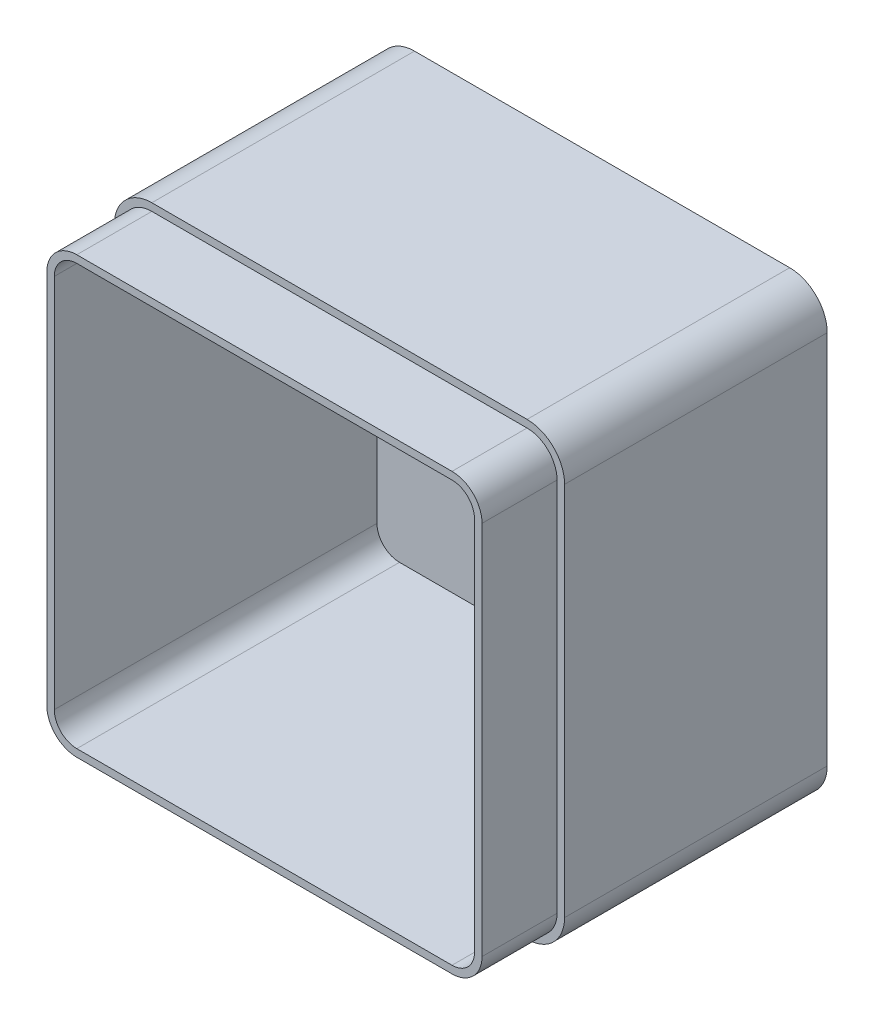
ISO-10303-21;
HEADER;
FILE_DESCRIPTION(('STEP AP214'),'2;1');
FILE_NAME('part.step','',(''),(''),'','','');
FILE_SCHEMA(('AUTOMOTIVE_DESIGN { 1 0 10303 214 1 1 1 1 }'));
ENDSEC;
DATA;
#1=APPLICATION_CONTEXT('core data for automotive mechanical design processes');
#2=APPLICATION_PROTOCOL_DEFINITION('international standard','automotive_design',2000,#1);
#3=PRODUCT_CONTEXT('',#1,'mechanical');
#4=PRODUCT('Part','Part','',(#3));
#5=PRODUCT_RELATED_PRODUCT_CATEGORY('part','',(#4));
#6=PRODUCT_DEFINITION_FORMATION('','',#4);
#7=PRODUCT_DEFINITION_CONTEXT('part definition',#1,'design');
#8=PRODUCT_DEFINITION('design','',#6,#7);
#9=PRODUCT_DEFINITION_SHAPE('','',#8);
#10=(LENGTH_UNIT() NAMED_UNIT(*) SI_UNIT(.MILLI.,.METRE.));
#11=(NAMED_UNIT(*) PLANE_ANGLE_UNIT() SI_UNIT($,.RADIAN.));
#12=(NAMED_UNIT(*) SI_UNIT($,.STERADIAN.) SOLID_ANGLE_UNIT());
#13=UNCERTAINTY_MEASURE_WITH_UNIT(LENGTH_MEASURE(1.E-05),#10,'distance_accuracy_value','');
#14=(GEOMETRIC_REPRESENTATION_CONTEXT(3) GLOBAL_UNCERTAINTY_ASSIGNED_CONTEXT((#13)) GLOBAL_UNIT_ASSIGNED_CONTEXT((#10,
#11,#12)) REPRESENTATION_CONTEXT('',''));
#15=CARTESIAN_POINT('',(0.,0.,0.));
#16=DIRECTION('',(0.,0.,1.));
#17=DIRECTION('',(1.,0.,0.));
#18=AXIS2_PLACEMENT_3D('',#15,#16,#17);
#19=CARTESIAN_POINT('',(0.,0.,90.));
#20=DIRECTION('',(0.,0.,-1.));
#21=DIRECTION('',(-1.,0.,0.));
#22=AXIS2_PLACEMENT_3D('',#19,#20,#21);
#23=PLANE('',#22);
#24=DIRECTION('',(1.,0.,0.));
#25=VECTOR('',#24,1.);
#26=CARTESIAN_POINT('',(0.,4.,90.));
#27=LINE('',#26,#25);
#28=CARTESIAN_POINT('',(9.99999999999999,4.,90.));
#29=VERTEX_POINT('',#28);
#30=CARTESIAN_POINT('',(110.,4.,90.));
#31=VERTEX_POINT('',#30);
#32=EDGE_CURVE('E331',#29,#31,#27,.T.);
#33=ORIENTED_EDGE('',*,*,#32,.F.);
#34=CARTESIAN_POINT('',(10.,10.,90.));
#35=DIRECTION('',(0.,0.,-1.));
#36=DIRECTION('',(-1.,0.,0.));
#37=AXIS2_PLACEMENT_3D('',#34,#35,#36);
#38=CIRCLE('',#37,6.);
#39=CARTESIAN_POINT('',(4.,9.99999999999999,90.));
#40=VERTEX_POINT('',#39);
#41=EDGE_CURVE('E332',#40,#29,#38,.F.);
#42=ORIENTED_EDGE('',*,*,#41,.F.);
#43=DIRECTION('',(0.,-1.,0.));
#44=VECTOR('',#43,1.);
#45=CARTESIAN_POINT('',(4.,0.,90.));
#46=LINE('',#45,#44);
#47=CARTESIAN_POINT('',(4.,110.,90.));
#48=VERTEX_POINT('',#47);
#49=EDGE_CURVE('E313',#48,#40,#46,.T.);
#50=ORIENTED_EDGE('',*,*,#49,.F.);
#51=CARTESIAN_POINT('',(10.,110.,90.));
#52=DIRECTION('',(0.,0.,-1.));
#53=DIRECTION('',(-1.,0.,0.));
#54=AXIS2_PLACEMENT_3D('',#51,#52,#53);
#55=CIRCLE('',#54,6.);
#56=CARTESIAN_POINT('',(9.99999999999999,116.,90.));
#57=VERTEX_POINT('',#56);
#58=EDGE_CURVE('E317',#57,#48,#55,.F.);
#59=ORIENTED_EDGE('',*,*,#58,.F.);
#60=DIRECTION('',(-1.,0.,0.));
#61=VECTOR('',#60,1.);
#62=CARTESIAN_POINT('',(0.,116.,90.));
#63=LINE('',#62,#61);
#64=CARTESIAN_POINT('',(110.,116.,90.));
#65=VERTEX_POINT('',#64);
#66=EDGE_CURVE('E324',#65,#57,#63,.T.);
#67=ORIENTED_EDGE('',*,*,#66,.F.);
#68=CARTESIAN_POINT('',(110.,110.,90.));
#69=DIRECTION('',(0.,0.,-1.));
#70=DIRECTION('',(-1.,0.,0.));
#71=AXIS2_PLACEMENT_3D('',#68,#69,#70);
#72=CIRCLE('',#71,6.);
#73=CARTESIAN_POINT('',(116.,110.,90.));
#74=VERTEX_POINT('',#73);
#75=EDGE_CURVE('E334',#74,#65,#72,.F.);
#76=ORIENTED_EDGE('',*,*,#75,.F.);
#77=DIRECTION('',(0.,1.,0.));
#78=VECTOR('',#77,1.);
#79=CARTESIAN_POINT('',(116.,0.,90.));
#80=LINE('',#79,#78);
#81=CARTESIAN_POINT('',(116.,9.99999999999999,90.));
#82=VERTEX_POINT('',#81);
#83=EDGE_CURVE('E337',#82,#74,#80,.T.);
#84=ORIENTED_EDGE('',*,*,#83,.F.);
#85=CARTESIAN_POINT('',(110.,10.,90.));
#86=DIRECTION('',(0.,0.,-1.));
#87=DIRECTION('',(-1.,0.,0.));
#88=AXIS2_PLACEMENT_3D('',#85,#86,#87);
#89=CIRCLE('',#88,6.);
#90=EDGE_CURVE('E329',#31,#82,#89,.F.);
#91=ORIENTED_EDGE('',*,*,#90,.F.);
#92=EDGE_LOOP('',(#33,#42,#50,#59,#67,#76,#84,#91));
#93=FACE_BOUND('',#92,.T.);
#94=CARTESIAN_POINT('',(10.,10.,90.));
#95=DIRECTION('',(0.,0.,1.));
#96=DIRECTION('',(1.,0.,0.));
#97=AXIS2_PLACEMENT_3D('',#94,#95,#96);
#98=CIRCLE('',#97,8.);
#99=CARTESIAN_POINT('',(2.,9.99999999999999,90.));
#100=VERTEX_POINT('',#99);
#101=CARTESIAN_POINT('',(10.,2.,90.));
#102=VERTEX_POINT('',#101);
#103=EDGE_CURVE('E242',#100,#102,#98,.T.);
#104=ORIENTED_EDGE('',*,*,#103,.T.);
#105=DIRECTION('',(1.,0.,0.));
#106=VECTOR('',#105,1.);
#107=CARTESIAN_POINT('',(10.,2.,90.));
#108=LINE('',#107,#106);
#109=CARTESIAN_POINT('',(110.,2.,90.));
#110=VERTEX_POINT('',#109);
#111=EDGE_CURVE('E202',#102,#110,#108,.T.);
#112=ORIENTED_EDGE('',*,*,#111,.T.);
#113=CARTESIAN_POINT('',(110.,10.,90.));
#114=DIRECTION('',(0.,0.,1.));
#115=DIRECTION('',(1.,0.,0.));
#116=AXIS2_PLACEMENT_3D('',#113,#114,#115);
#117=CIRCLE('',#116,7.99999999999999);
#118=CARTESIAN_POINT('',(118.,10.,90.));
#119=VERTEX_POINT('',#118);
#120=EDGE_CURVE('E50',#110,#119,#117,.T.);
#121=ORIENTED_EDGE('',*,*,#120,.T.);
#122=DIRECTION('',(0.,1.,0.));
#123=VECTOR('',#122,1.);
#124=CARTESIAN_POINT('',(118.,10.,90.));
#125=LINE('',#124,#123);
#126=CARTESIAN_POINT('',(118.,110.,90.));
#127=VERTEX_POINT('',#126);
#128=EDGE_CURVE('E246',#119,#127,#125,.T.);
#129=ORIENTED_EDGE('',*,*,#128,.T.);
#130=CARTESIAN_POINT('',(110.,110.,90.));
#131=DIRECTION('',(0.,0.,1.));
#132=DIRECTION('',(1.,0.,0.));
#133=AXIS2_PLACEMENT_3D('',#130,#131,#132);
#134=CIRCLE('',#133,7.99999999999999);
#135=CARTESIAN_POINT('',(110.,118.,90.));
#136=VERTEX_POINT('',#135);
#137=EDGE_CURVE('E249',#127,#136,#134,.T.);
#138=ORIENTED_EDGE('',*,*,#137,.T.);
#139=DIRECTION('',(-1.,0.,0.));
#140=VECTOR('',#139,1.);
#141=CARTESIAN_POINT('',(110.,118.,90.));
#142=LINE('',#141,#140);
#143=CARTESIAN_POINT('',(9.99999999999999,118.,90.));
#144=VERTEX_POINT('',#143);
#145=EDGE_CURVE('E252',#136,#144,#142,.T.);
#146=ORIENTED_EDGE('',*,*,#145,.T.);
#147=CARTESIAN_POINT('',(10.,110.,90.));
#148=DIRECTION('',(0.,0.,1.));
#149=DIRECTION('',(1.,0.,0.));
#150=AXIS2_PLACEMENT_3D('',#147,#148,#149);
#151=CIRCLE('',#150,7.99999999999999);
#152=CARTESIAN_POINT('',(2.,110.,90.));
#153=VERTEX_POINT('',#152);
#154=EDGE_CURVE('E225',#144,#153,#151,.T.);
#155=ORIENTED_EDGE('',*,*,#154,.T.);
#156=DIRECTION('',(0.,-1.,0.));
#157=VECTOR('',#156,1.);
#158=CARTESIAN_POINT('',(2.,110.,90.));
#159=LINE('',#158,#157);
#160=EDGE_CURVE('E222',#153,#100,#159,.T.);
#161=ORIENTED_EDGE('',*,*,#160,.T.);
#162=EDGE_LOOP('',(#104,#112,#121,#129,#138,#146,#155,#161));
#163=FACE_BOUND('',#162,.T.);
#164=ADVANCED_FACE('F35',(#93,#163),#23,.F.);
#165=CARTESIAN_POINT('',(4.,0.,90.));
#166=DIRECTION('',(1.,0.,0.));
#167=DIRECTION('',(0.,0.,-1.));
#168=AXIS2_PLACEMENT_3D('',#165,#166,#167);
#169=PLANE('',#168);
#170=DIRECTION('',(0.,-1.,0.));
#171=VECTOR('',#170,1.);
#172=CARTESIAN_POINT('',(4.,0.,4.));
#173=LINE('',#172,#171);
#174=CARTESIAN_POINT('',(4.,110.,4.));
#175=VERTEX_POINT('',#174);
#176=CARTESIAN_POINT('',(4.,9.99999999999999,4.));
#177=VERTEX_POINT('',#176);
#178=EDGE_CURVE('E284',#175,#177,#173,.T.);
#179=ORIENTED_EDGE('',*,*,#178,.F.);
#180=DIRECTION('',(0.,0.,-1.));
#181=VECTOR('',#180,1.);
#182=CARTESIAN_POINT('',(4.,110.,90.));
#183=LINE('',#182,#181);
#184=EDGE_CURVE('E292',#48,#175,#183,.T.);
#185=ORIENTED_EDGE('',*,*,#184,.F.);
#186=ORIENTED_EDGE('',*,*,#49,.T.);
#187=DIRECTION('',(0.,0.,-1.));
#188=VECTOR('',#187,1.);
#189=CARTESIAN_POINT('',(4.,9.99999999999999,90.));
#190=LINE('',#189,#188);
#191=EDGE_CURVE('E288',#177,#40,#190,.F.);
#192=ORIENTED_EDGE('',*,*,#191,.F.);
#193=EDGE_LOOP('',(#179,#185,#186,#192));
#194=FACE_BOUND('',#193,.T.);
#195=ADVANCED_FACE('F428',(#194),#169,.T.);
#196=CARTESIAN_POINT('',(0.,4.,90.));
#197=DIRECTION('',(0.,1.,0.));
#198=DIRECTION('',(0.,0.,1.));
#199=AXIS2_PLACEMENT_3D('',#196,#197,#198);
#200=PLANE('',#199);
#201=DIRECTION('',(1.,0.,0.));
#202=VECTOR('',#201,1.);
#203=CARTESIAN_POINT('',(0.,4.,4.));
#204=LINE('',#203,#202);
#205=CARTESIAN_POINT('',(9.99999999999999,4.,4.));
#206=VERTEX_POINT('',#205);
#207=CARTESIAN_POINT('',(110.,4.,4.));
#208=VERTEX_POINT('',#207);
#209=EDGE_CURVE('E287',#206,#208,#204,.T.);
#210=ORIENTED_EDGE('',*,*,#209,.F.);
#211=DIRECTION('',(0.,0.,1.));
#212=VECTOR('',#211,1.);
#213=CARTESIAN_POINT('',(9.99999999999999,4.,90.));
#214=LINE('',#213,#212);
#215=EDGE_CURVE('E302',#29,#206,#214,.F.);
#216=ORIENTED_EDGE('',*,*,#215,.F.);
#217=ORIENTED_EDGE('',*,*,#32,.T.);
#218=DIRECTION('',(0.,0.,1.));
#219=VECTOR('',#218,1.);
#220=CARTESIAN_POINT('',(110.,4.,90.));
#221=LINE('',#220,#219);
#222=EDGE_CURVE('E315',#208,#31,#221,.T.);
#223=ORIENTED_EDGE('',*,*,#222,.F.);
#224=EDGE_LOOP('',(#210,#216,#217,#223));
#225=FACE_BOUND('',#224,.T.);
#226=ADVANCED_FACE('F434',(#225),#200,.T.);
#227=CARTESIAN_POINT('',(116.,0.,90.));
#228=DIRECTION('',(-1.,0.,0.));
#229=DIRECTION('',(0.,0.,1.));
#230=AXIS2_PLACEMENT_3D('',#227,#228,#229);
#231=PLANE('',#230);
#232=ORIENTED_EDGE('',*,*,#83,.T.);
#233=DIRECTION('',(0.,0.,1.));
#234=VECTOR('',#233,1.);
#235=CARTESIAN_POINT('',(116.,110.,90.));
#236=LINE('',#235,#234);
#237=CARTESIAN_POINT('',(116.,110.,4.));
#238=VERTEX_POINT('',#237);
#239=EDGE_CURVE('E322',#238,#74,#236,.T.);
#240=ORIENTED_EDGE('',*,*,#239,.F.);
#241=DIRECTION('',(0.,1.,0.));
#242=VECTOR('',#241,1.);
#243=CARTESIAN_POINT('',(116.,0.,4.));
#244=LINE('',#243,#242);
#245=CARTESIAN_POINT('',(116.,9.99999999999999,4.));
#246=VERTEX_POINT('',#245);
#247=EDGE_CURVE('E296',#246,#238,#244,.T.);
#248=ORIENTED_EDGE('',*,*,#247,.F.);
#249=DIRECTION('',(0.,0.,1.));
#250=VECTOR('',#249,1.);
#251=CARTESIAN_POINT('',(116.,9.99999999999999,90.));
#252=LINE('',#251,#250);
#253=EDGE_CURVE('E310',#82,#246,#252,.F.);
#254=ORIENTED_EDGE('',*,*,#253,.F.);
#255=EDGE_LOOP('',(#232,#240,#248,#254));
#256=FACE_BOUND('',#255,.T.);
#257=ADVANCED_FACE('F463',(#256),#231,.T.);
#258=CARTESIAN_POINT('',(0.,116.,90.));
#259=DIRECTION('',(0.,-1.,0.));
#260=DIRECTION('',(0.,0.,-1.));
#261=AXIS2_PLACEMENT_3D('',#258,#259,#260);
#262=PLANE('',#261);
#263=ORIENTED_EDGE('',*,*,#66,.T.);
#264=DIRECTION('',(0.,0.,-1.));
#265=VECTOR('',#264,1.);
#266=CARTESIAN_POINT('',(9.99999999999999,116.,90.));
#267=LINE('',#266,#265);
#268=CARTESIAN_POINT('',(9.99999999999999,116.,4.));
#269=VERTEX_POINT('',#268);
#270=EDGE_CURVE('E327',#269,#57,#267,.F.);
#271=ORIENTED_EDGE('',*,*,#270,.F.);
#272=DIRECTION('',(-1.,0.,0.));
#273=VECTOR('',#272,1.);
#274=CARTESIAN_POINT('',(0.,116.,4.));
#275=LINE('',#274,#273);
#276=CARTESIAN_POINT('',(110.,116.,4.));
#277=VERTEX_POINT('',#276);
#278=EDGE_CURVE('E299',#277,#269,#275,.T.);
#279=ORIENTED_EDGE('',*,*,#278,.F.);
#280=DIRECTION('',(0.,0.,-1.));
#281=VECTOR('',#280,1.);
#282=CARTESIAN_POINT('',(110.,116.,90.));
#283=LINE('',#282,#281);
#284=EDGE_CURVE('E295',#65,#277,#283,.T.);
#285=ORIENTED_EDGE('',*,*,#284,.F.);
#286=EDGE_LOOP('',(#263,#271,#279,#285));
#287=FACE_BOUND('',#286,.T.);
#288=ADVANCED_FACE('F467',(#287),#262,.T.);
#289=CARTESIAN_POINT('',(0.,0.,4.));
#290=DIRECTION('',(0.,0.,-1.));
#291=DIRECTION('',(-1.,0.,0.));
#292=AXIS2_PLACEMENT_3D('',#289,#290,#291);
#293=PLANE('',#292);
#294=ORIENTED_EDGE('',*,*,#247,.T.);
#295=CARTESIAN_POINT('',(110.,110.,4.));
#296=DIRECTION('',(0.,0.,-1.));
#297=DIRECTION('',(-1.,0.,0.));
#298=AXIS2_PLACEMENT_3D('',#295,#296,#297);
#299=CIRCLE('',#298,6.);
#300=EDGE_CURVE('E303',#277,#238,#299,.T.);
#301=ORIENTED_EDGE('',*,*,#300,.F.);
#302=ORIENTED_EDGE('',*,*,#278,.T.);
#303=CARTESIAN_POINT('',(10.,110.,4.));
#304=DIRECTION('',(0.,0.,-1.));
#305=DIRECTION('',(-1.,0.,0.));
#306=AXIS2_PLACEMENT_3D('',#303,#304,#305);
#307=CIRCLE('',#306,6.);
#308=EDGE_CURVE('E308',#175,#269,#307,.T.);
#309=ORIENTED_EDGE('',*,*,#308,.F.);
#310=ORIENTED_EDGE('',*,*,#178,.T.);
#311=CARTESIAN_POINT('',(10.,10.,4.));
#312=DIRECTION('',(0.,0.,-1.));
#313=DIRECTION('',(-1.,0.,0.));
#314=AXIS2_PLACEMENT_3D('',#311,#312,#313);
#315=CIRCLE('',#314,6.);
#316=EDGE_CURVE('E306',#206,#177,#315,.T.);
#317=ORIENTED_EDGE('',*,*,#316,.F.);
#318=ORIENTED_EDGE('',*,*,#209,.T.);
#319=CARTESIAN_POINT('',(110.,10.,4.));
#320=DIRECTION('',(0.,0.,-1.));
#321=DIRECTION('',(-1.,0.,0.));
#322=AXIS2_PLACEMENT_3D('',#319,#320,#321);
#323=CIRCLE('',#322,6.);
#324=EDGE_CURVE('E300',#246,#208,#323,.T.);
#325=ORIENTED_EDGE('',*,*,#324,.F.);
#326=EDGE_LOOP('',(#294,#301,#302,#309,#310,#317,#318,#325));
#327=FACE_BOUND('',#326,.T.);
#328=ADVANCED_FACE('F471',(#327),#293,.F.);
#329=CARTESIAN_POINT('',(110.,10.,90.));
#330=DIRECTION('',(0.,0.,-1.));
#331=DIRECTION('',(-1.,0.,0.));
#332=AXIS2_PLACEMENT_3D('',#329,#330,#331);
#333=CYLINDRICAL_SURFACE('',#332,6.);
#334=ORIENTED_EDGE('',*,*,#90,.T.);
#335=ORIENTED_EDGE('',*,*,#253,.T.);
#336=ORIENTED_EDGE('',*,*,#324,.T.);
#337=ORIENTED_EDGE('',*,*,#222,.T.);
#338=EDGE_LOOP('',(#334,#335,#336,#337));
#339=FACE_BOUND('',#338,.T.);
#340=ADVANCED_FACE('F475',(#339),#333,.F.);
#341=CARTESIAN_POINT('',(110.,110.,90.));
#342=DIRECTION('',(0.,0.,-1.));
#343=DIRECTION('',(-1.,0.,0.));
#344=AXIS2_PLACEMENT_3D('',#341,#342,#343);
#345=CYLINDRICAL_SURFACE('',#344,6.);
#346=ORIENTED_EDGE('',*,*,#75,.T.);
#347=ORIENTED_EDGE('',*,*,#284,.T.);
#348=ORIENTED_EDGE('',*,*,#300,.T.);
#349=ORIENTED_EDGE('',*,*,#239,.T.);
#350=EDGE_LOOP('',(#346,#347,#348,#349));
#351=FACE_BOUND('',#350,.T.);
#352=ADVANCED_FACE('F479',(#351),#345,.F.);
#353=CARTESIAN_POINT('',(10.,10.,90.));
#354=DIRECTION('',(0.,0.,-1.));
#355=DIRECTION('',(-1.,0.,0.));
#356=AXIS2_PLACEMENT_3D('',#353,#354,#355);
#357=CYLINDRICAL_SURFACE('',#356,6.);
#358=ORIENTED_EDGE('',*,*,#41,.T.);
#359=ORIENTED_EDGE('',*,*,#215,.T.);
#360=ORIENTED_EDGE('',*,*,#316,.T.);
#361=ORIENTED_EDGE('',*,*,#191,.T.);
#362=EDGE_LOOP('',(#358,#359,#360,#361));
#363=FACE_BOUND('',#362,.T.);
#364=ADVANCED_FACE('F482',(#363),#357,.F.);
#365=CARTESIAN_POINT('',(10.,110.,90.));
#366=DIRECTION('',(0.,0.,-1.));
#367=DIRECTION('',(-1.,0.,0.));
#368=AXIS2_PLACEMENT_3D('',#365,#366,#367);
#369=CYLINDRICAL_SURFACE('',#368,6.);
#370=ORIENTED_EDGE('',*,*,#58,.T.);
#371=ORIENTED_EDGE('',*,*,#184,.T.);
#372=ORIENTED_EDGE('',*,*,#308,.T.);
#373=ORIENTED_EDGE('',*,*,#270,.T.);
#374=EDGE_LOOP('',(#370,#371,#372,#373));
#375=FACE_BOUND('',#374,.T.);
#376=ADVANCED_FACE('F440',(#375),#369,.F.);
#377=CARTESIAN_POINT('',(10.,10.,70.));
#378=DIRECTION('',(0.,0.,1.));
#379=DIRECTION('',(1.,0.,0.));
#380=AXIS2_PLACEMENT_3D('',#377,#378,#379);
#381=PLANE('',#380);
#382=DIRECTION('',(0.,-1.,0.));
#383=VECTOR('',#382,1.);
#384=CARTESIAN_POINT('',(2.,110.,70.));
#385=LINE('',#384,#383);
#386=CARTESIAN_POINT('',(2.,110.,70.));
#387=VERTEX_POINT('',#386);
#388=CARTESIAN_POINT('',(2.,9.99999999999999,70.));
#389=VERTEX_POINT('',#388);
#390=EDGE_CURVE('E208',#387,#389,#385,.T.);
#391=ORIENTED_EDGE('',*,*,#390,.F.);
#392=CARTESIAN_POINT('',(10.,110.,70.));
#393=DIRECTION('',(0.,0.,1.));
#394=DIRECTION('',(1.,0.,0.));
#395=AXIS2_PLACEMENT_3D('',#392,#393,#394);
#396=CIRCLE('',#395,7.99999999999999);
#397=CARTESIAN_POINT('',(9.99999999999999,118.,70.));
#398=VERTEX_POINT('',#397);
#399=EDGE_CURVE('E238',#398,#387,#396,.T.);
#400=ORIENTED_EDGE('',*,*,#399,.F.);
#401=DIRECTION('',(-1.,0.,0.));
#402=VECTOR('',#401,1.);
#403=CARTESIAN_POINT('',(110.,118.,70.));
#404=LINE('',#403,#402);
#405=CARTESIAN_POINT('',(110.,118.,70.));
#406=VERTEX_POINT('',#405);
#407=EDGE_CURVE('E235',#406,#398,#404,.T.);
#408=ORIENTED_EDGE('',*,*,#407,.F.);
#409=CARTESIAN_POINT('',(110.,110.,70.));
#410=DIRECTION('',(0.,0.,1.));
#411=DIRECTION('',(1.,0.,0.));
#412=AXIS2_PLACEMENT_3D('',#409,#410,#411);
#413=CIRCLE('',#412,7.99999999999999);
#414=CARTESIAN_POINT('',(118.,110.,70.));
#415=VERTEX_POINT('',#414);
#416=EDGE_CURVE('E232',#415,#406,#413,.T.);
#417=ORIENTED_EDGE('',*,*,#416,.F.);
#418=DIRECTION('',(0.,1.,0.));
#419=VECTOR('',#418,1.);
#420=CARTESIAN_POINT('',(118.,10.,70.));
#421=LINE('',#420,#419);
#422=CARTESIAN_POINT('',(118.,10.,70.));
#423=VERTEX_POINT('',#422);
#424=EDGE_CURVE('E229',#423,#415,#421,.T.);
#425=ORIENTED_EDGE('',*,*,#424,.F.);
#426=CARTESIAN_POINT('',(110.,10.,70.));
#427=DIRECTION('',(0.,0.,1.));
#428=DIRECTION('',(1.,0.,0.));
#429=AXIS2_PLACEMENT_3D('',#426,#427,#428);
#430=CIRCLE('',#429,7.99999999999999);
#431=CARTESIAN_POINT('',(110.,2.,70.));
#432=VERTEX_POINT('',#431);
#433=EDGE_CURVE('E218',#432,#423,#430,.T.);
#434=ORIENTED_EDGE('',*,*,#433,.F.);
#435=DIRECTION('',(1.,0.,0.));
#436=VECTOR('',#435,1.);
#437=CARTESIAN_POINT('',(10.,2.,70.));
#438=LINE('',#437,#436);
#439=CARTESIAN_POINT('',(10.,2.,70.));
#440=VERTEX_POINT('',#439);
#441=EDGE_CURVE('E200',#440,#432,#438,.T.);
#442=ORIENTED_EDGE('',*,*,#441,.F.);
#443=CARTESIAN_POINT('',(10.,10.,70.));
#444=DIRECTION('',(0.,0.,1.));
#445=DIRECTION('',(1.,0.,0.));
#446=AXIS2_PLACEMENT_3D('',#443,#444,#445);
#447=CIRCLE('',#446,8.);
#448=EDGE_CURVE('E214',#389,#440,#447,.T.);
#449=ORIENTED_EDGE('',*,*,#448,.F.);
#450=EDGE_LOOP('',(#391,#400,#408,#417,#425,#434,#442,#449));
#451=FACE_BOUND('',#450,.T.);
#452=CARTESIAN_POINT('',(10.,10.,70.));
#453=DIRECTION('',(0.,0.,1.));
#454=DIRECTION('',(1.,0.,0.));
#455=AXIS2_PLACEMENT_3D('',#452,#453,#454);
#456=CIRCLE('',#455,10.);
#457=CARTESIAN_POINT('',(0.,10.,70.));
#458=VERTEX_POINT('',#457);
#459=CARTESIAN_POINT('',(10.,0.,70.));
#460=VERTEX_POINT('',#459);
#461=EDGE_CURVE('E258',#458,#460,#456,.T.);
#462=ORIENTED_EDGE('',*,*,#461,.T.);
#463=DIRECTION('',(1.,0.,0.));
#464=VECTOR('',#463,1.);
#465=CARTESIAN_POINT('',(10.,0.,70.));
#466=LINE('',#465,#464);
#467=CARTESIAN_POINT('',(110.,0.,70.));
#468=VERTEX_POINT('',#467);
#469=EDGE_CURVE('E271',#460,#468,#466,.T.);
#470=ORIENTED_EDGE('',*,*,#469,.T.);
#471=CARTESIAN_POINT('',(110.,10.,70.));
#472=DIRECTION('',(0.,0.,1.));
#473=DIRECTION('',(1.,0.,0.));
#474=AXIS2_PLACEMENT_3D('',#471,#472,#473);
#475=CIRCLE('',#474,9.99999999999999);
#476=CARTESIAN_POINT('',(120.,10.,70.));
#477=VERTEX_POINT('',#476);
#478=EDGE_CURVE('E273',#468,#477,#475,.T.);
#479=ORIENTED_EDGE('',*,*,#478,.T.);
#480=DIRECTION('',(0.,1.,0.));
#481=VECTOR('',#480,1.);
#482=CARTESIAN_POINT('',(120.,10.,70.));
#483=LINE('',#482,#481);
#484=CARTESIAN_POINT('',(120.,110.,70.));
#485=VERTEX_POINT('',#484);
#486=EDGE_CURVE('E275',#477,#485,#483,.T.);
#487=ORIENTED_EDGE('',*,*,#486,.T.);
#488=CARTESIAN_POINT('',(110.,110.,70.));
#489=DIRECTION('',(0.,0.,1.));
#490=DIRECTION('',(1.,0.,0.));
#491=AXIS2_PLACEMENT_3D('',#488,#489,#490);
#492=CIRCLE('',#491,9.99999999999999);
#493=CARTESIAN_POINT('',(110.,120.,70.));
#494=VERTEX_POINT('',#493);
#495=EDGE_CURVE('E277',#485,#494,#492,.T.);
#496=ORIENTED_EDGE('',*,*,#495,.T.);
#497=DIRECTION('',(-1.,0.,0.));
#498=VECTOR('',#497,1.);
#499=CARTESIAN_POINT('',(110.,120.,70.));
#500=LINE('',#499,#498);
#501=CARTESIAN_POINT('',(10.,120.,70.));
#502=VERTEX_POINT('',#501);
#503=EDGE_CURVE('E58',#494,#502,#500,.T.);
#504=ORIENTED_EDGE('',*,*,#503,.T.);
#505=CARTESIAN_POINT('',(10.,110.,70.));
#506=DIRECTION('',(0.,0.,1.));
#507=DIRECTION('',(1.,0.,0.));
#508=AXIS2_PLACEMENT_3D('',#505,#506,#507);
#509=CIRCLE('',#508,9.99999999999999);
#510=CARTESIAN_POINT('',(0.,110.,70.));
#511=VERTEX_POINT('',#510);
#512=EDGE_CURVE('E280',#502,#511,#509,.T.);
#513=ORIENTED_EDGE('',*,*,#512,.T.);
#514=DIRECTION('',(0.,-1.,0.));
#515=VECTOR('',#514,1.);
#516=CARTESIAN_POINT('',(0.,110.,70.));
#517=LINE('',#516,#515);
#518=EDGE_CURVE('E282',#511,#458,#517,.T.);
#519=ORIENTED_EDGE('',*,*,#518,.T.);
#520=EDGE_LOOP('',(#462,#470,#479,#487,#496,#504,#513,#519));
#521=FACE_BOUND('',#520,.T.);
#522=ADVANCED_FACE('F213',(#451,#521),#381,.T.);
#523=CARTESIAN_POINT('',(10.,10.,70.));
#524=DIRECTION('',(0.,0.,1.));
#525=DIRECTION('',(1.,0.,0.));
#526=AXIS2_PLACEMENT_3D('',#523,#524,#525);
#527=CYLINDRICAL_SURFACE('',#526,8.);
#528=ORIENTED_EDGE('',*,*,#103,.F.);
#529=DIRECTION('',(0.,0.,1.));
#530=VECTOR('',#529,1.);
#531=CARTESIAN_POINT('',(2.,9.99999999999999,70.));
#532=LINE('',#531,#530);
#533=EDGE_CURVE('E221',#389,#100,#532,.T.);
#534=ORIENTED_EDGE('',*,*,#533,.F.);
#535=ORIENTED_EDGE('',*,*,#448,.T.);
#536=DIRECTION('',(0.,0.,1.));
#537=VECTOR('',#536,1.);
#538=CARTESIAN_POINT('',(10.,2.,70.));
#539=LINE('',#538,#537);
#540=EDGE_CURVE('E197',#440,#102,#539,.T.);
#541=ORIENTED_EDGE('',*,*,#540,.T.);
#542=EDGE_LOOP('',(#528,#534,#535,#541));
#543=FACE_BOUND('',#542,.T.);
#544=ADVANCED_FACE('F220',(#543),#527,.T.);
#545=CARTESIAN_POINT('',(2.,110.,70.));
#546=DIRECTION('',(-1.,0.,0.));
#547=DIRECTION('',(0.,-1.,0.));
#548=AXIS2_PLACEMENT_3D('',#545,#546,#547);
#549=PLANE('',#548);
#550=ORIENTED_EDGE('',*,*,#160,.F.);
#551=DIRECTION('',(0.,0.,1.));
#552=VECTOR('',#551,1.);
#553=CARTESIAN_POINT('',(2.,110.,70.));
#554=LINE('',#553,#552);
#555=EDGE_CURVE('E259',#387,#153,#554,.T.);
#556=ORIENTED_EDGE('',*,*,#555,.F.);
#557=ORIENTED_EDGE('',*,*,#390,.T.);
#558=ORIENTED_EDGE('',*,*,#533,.T.);
#559=EDGE_LOOP('',(#550,#556,#557,#558));
#560=FACE_BOUND('',#559,.T.);
#561=ADVANCED_FACE('F458',(#560),#549,.T.);
#562=CARTESIAN_POINT('',(10.,110.,70.));
#563=DIRECTION('',(0.,0.,1.));
#564=DIRECTION('',(1.,0.,0.));
#565=AXIS2_PLACEMENT_3D('',#562,#563,#564);
#566=CYLINDRICAL_SURFACE('',#565,7.99999999999999);
#567=ORIENTED_EDGE('',*,*,#154,.F.);
#568=DIRECTION('',(0.,0.,1.));
#569=VECTOR('',#568,1.);
#570=CARTESIAN_POINT('',(9.99999999999999,118.,70.));
#571=LINE('',#570,#569);
#572=EDGE_CURVE('E261',#398,#144,#571,.T.);
#573=ORIENTED_EDGE('',*,*,#572,.F.);
#574=ORIENTED_EDGE('',*,*,#399,.T.);
#575=ORIENTED_EDGE('',*,*,#555,.T.);
#576=EDGE_LOOP('',(#567,#573,#574,#575));
#577=FACE_BOUND('',#576,.T.);
#578=ADVANCED_FACE('F525',(#577),#566,.T.);
#579=CARTESIAN_POINT('',(110.,118.,70.));
#580=DIRECTION('',(0.,1.,0.));
#581=DIRECTION('',(0.,0.,1.));
#582=AXIS2_PLACEMENT_3D('',#579,#580,#581);
#583=PLANE('',#582);
#584=ORIENTED_EDGE('',*,*,#145,.F.);
#585=DIRECTION('',(0.,0.,1.));
#586=VECTOR('',#585,1.);
#587=CARTESIAN_POINT('',(110.,118.,70.));
#588=LINE('',#587,#586);
#589=EDGE_CURVE('E263',#406,#136,#588,.T.);
#590=ORIENTED_EDGE('',*,*,#589,.F.);
#591=ORIENTED_EDGE('',*,*,#407,.T.);
#592=ORIENTED_EDGE('',*,*,#572,.T.);
#593=EDGE_LOOP('',(#584,#590,#591,#592));
#594=FACE_BOUND('',#593,.T.);
#595=ADVANCED_FACE('F533',(#594),#583,.T.);
#596=CARTESIAN_POINT('',(110.,110.,70.));
#597=DIRECTION('',(0.,0.,1.));
#598=DIRECTION('',(1.,0.,0.));
#599=AXIS2_PLACEMENT_3D('',#596,#597,#598);
#600=CYLINDRICAL_SURFACE('',#599,7.99999999999999);
#601=ORIENTED_EDGE('',*,*,#137,.F.);
#602=DIRECTION('',(0.,0.,1.));
#603=VECTOR('',#602,1.);
#604=CARTESIAN_POINT('',(118.,110.,70.));
#605=LINE('',#604,#603);
#606=EDGE_CURVE('E265',#415,#127,#605,.T.);
#607=ORIENTED_EDGE('',*,*,#606,.F.);
#608=ORIENTED_EDGE('',*,*,#416,.T.);
#609=ORIENTED_EDGE('',*,*,#589,.T.);
#610=EDGE_LOOP('',(#601,#607,#608,#609));
#611=FACE_BOUND('',#610,.T.);
#612=ADVANCED_FACE('F541',(#611),#600,.T.);
#613=CARTESIAN_POINT('',(118.,10.,70.));
#614=DIRECTION('',(1.,0.,0.));
#615=DIRECTION('',(0.,0.,-1.));
#616=AXIS2_PLACEMENT_3D('',#613,#614,#615);
#617=PLANE('',#616);
#618=ORIENTED_EDGE('',*,*,#128,.F.);
#619=DIRECTION('',(0.,0.,1.));
#620=VECTOR('',#619,1.);
#621=CARTESIAN_POINT('',(118.,10.,70.));
#622=LINE('',#621,#620);
#623=EDGE_CURVE('E267',#423,#119,#622,.T.);
#624=ORIENTED_EDGE('',*,*,#623,.F.);
#625=ORIENTED_EDGE('',*,*,#424,.T.);
#626=ORIENTED_EDGE('',*,*,#606,.T.);
#627=EDGE_LOOP('',(#618,#624,#625,#626));
#628=FACE_BOUND('',#627,.T.);
#629=ADVANCED_FACE('F452',(#628),#617,.T.);
#630=CARTESIAN_POINT('',(110.,10.,70.));
#631=DIRECTION('',(0.,0.,1.));
#632=DIRECTION('',(1.,0.,0.));
#633=AXIS2_PLACEMENT_3D('',#630,#631,#632);
#634=CYLINDRICAL_SURFACE('',#633,7.99999999999999);
#635=ORIENTED_EDGE('',*,*,#120,.F.);
#636=DIRECTION('',(0.,0.,1.));
#637=VECTOR('',#636,1.);
#638=CARTESIAN_POINT('',(110.,2.,70.));
#639=LINE('',#638,#637);
#640=EDGE_CURVE('E207',#432,#110,#639,.T.);
#641=ORIENTED_EDGE('',*,*,#640,.F.);
#642=ORIENTED_EDGE('',*,*,#433,.T.);
#643=ORIENTED_EDGE('',*,*,#623,.T.);
#644=EDGE_LOOP('',(#635,#641,#642,#643));
#645=FACE_BOUND('',#644,.T.);
#646=ADVANCED_FACE('F447',(#645),#634,.T.);
#647=CARTESIAN_POINT('',(10.,2.,70.));
#648=DIRECTION('',(0.,-1.,0.));
#649=DIRECTION('',(0.,0.,-1.));
#650=AXIS2_PLACEMENT_3D('',#647,#648,#649);
#651=PLANE('',#650);
#652=ORIENTED_EDGE('',*,*,#111,.F.);
#653=ORIENTED_EDGE('',*,*,#540,.F.);
#654=ORIENTED_EDGE('',*,*,#441,.T.);
#655=ORIENTED_EDGE('',*,*,#640,.T.);
#656=EDGE_LOOP('',(#652,#653,#654,#655));
#657=FACE_BOUND('',#656,.T.);
#658=ADVANCED_FACE('F199',(#657),#651,.T.);
#659=CARTESIAN_POINT('',(0.,0.,0.));
#660=DIRECTION('',(0.,0.,-1.));
#661=DIRECTION('',(-1.,0.,0.));
#662=AXIS2_PLACEMENT_3D('',#659,#660,#661);
#663=PLANE('',#662);
#664=DIRECTION('',(0.,1.,0.));
#665=VECTOR('',#664,1.);
#666=CARTESIAN_POINT('',(120.,0.,0.));
#667=LINE('',#666,#665);
#668=CARTESIAN_POINT('',(120.,10.,0.));
#669=VERTEX_POINT('',#668);
#670=CARTESIAN_POINT('',(120.,110.,0.));
#671=VERTEX_POINT('',#670);
#672=EDGE_CURVE('E350',#669,#671,#667,.T.);
#673=ORIENTED_EDGE('',*,*,#672,.F.);
#674=CARTESIAN_POINT('',(110.,10.,0.));
#675=DIRECTION('',(0.,0.,-1.));
#676=DIRECTION('',(-1.,0.,0.));
#677=AXIS2_PLACEMENT_3D('',#674,#675,#676);
#678=CIRCLE('',#677,10.);
#679=CARTESIAN_POINT('',(110.,0.,0.));
#680=VERTEX_POINT('',#679);
#681=EDGE_CURVE('E367',#669,#680,#678,.T.);
#682=ORIENTED_EDGE('',*,*,#681,.T.);
#683=DIRECTION('',(1.,0.,0.));
#684=VECTOR('',#683,1.);
#685=CARTESIAN_POINT('',(0.,0.,0.));
#686=LINE('',#685,#684);
#687=CARTESIAN_POINT('',(10.,0.,0.));
#688=VERTEX_POINT('',#687);
#689=EDGE_CURVE('E347',#688,#680,#686,.T.);
#690=ORIENTED_EDGE('',*,*,#689,.F.);
#691=CARTESIAN_POINT('',(10.,10.,0.));
#692=DIRECTION('',(0.,0.,-1.));
#693=DIRECTION('',(-1.,0.,0.));
#694=AXIS2_PLACEMENT_3D('',#691,#692,#693);
#695=CIRCLE('',#694,10.);
#696=CARTESIAN_POINT('',(0.,10.,0.));
#697=VERTEX_POINT('',#696);
#698=EDGE_CURVE('E363',#688,#697,#695,.T.);
#699=ORIENTED_EDGE('',*,*,#698,.T.);
#700=DIRECTION('',(0.,-1.,0.));
#701=VECTOR('',#700,1.);
#702=CARTESIAN_POINT('',(0.,0.,0.));
#703=LINE('',#702,#701);
#704=CARTESIAN_POINT('',(0.,110.,0.));
#705=VERTEX_POINT('',#704);
#706=EDGE_CURVE('E291',#705,#697,#703,.T.);
#707=ORIENTED_EDGE('',*,*,#706,.F.);
#708=CARTESIAN_POINT('',(10.,110.,0.));
#709=DIRECTION('',(0.,0.,-1.));
#710=DIRECTION('',(-1.,0.,0.));
#711=AXIS2_PLACEMENT_3D('',#708,#709,#710);
#712=CIRCLE('',#711,10.);
#713=CARTESIAN_POINT('',(10.,120.,0.));
#714=VERTEX_POINT('',#713);
#715=EDGE_CURVE('E361',#705,#714,#712,.T.);
#716=ORIENTED_EDGE('',*,*,#715,.T.);
#717=DIRECTION('',(-1.,0.,0.));
#718=VECTOR('',#717,1.);
#719=CARTESIAN_POINT('',(0.,120.,0.));
#720=LINE('',#719,#718);
#721=CARTESIAN_POINT('',(110.,120.,0.));
#722=VERTEX_POINT('',#721);
#723=EDGE_CURVE('E353',#722,#714,#720,.T.);
#724=ORIENTED_EDGE('',*,*,#723,.F.);
#725=CARTESIAN_POINT('',(110.,110.,0.));
#726=DIRECTION('',(0.,0.,-1.));
#727=DIRECTION('',(-1.,0.,0.));
#728=AXIS2_PLACEMENT_3D('',#725,#726,#727);
#729=CIRCLE('',#728,10.);
#730=EDGE_CURVE('E365',#722,#671,#729,.T.);
#731=ORIENTED_EDGE('',*,*,#730,.T.);
#732=EDGE_LOOP('',(#673,#682,#690,#699,#707,#716,#724,#731));
#733=FACE_BOUND('',#732,.T.);
#734=ADVANCED_FACE('F390',(#733),#663,.T.);
#735=CARTESIAN_POINT('',(10.,110.,90.));
#736=DIRECTION('',(0.,0.,-1.));
#737=DIRECTION('',(-1.,0.,0.));
#738=AXIS2_PLACEMENT_3D('',#735,#736,#737);
#739=CYLINDRICAL_SURFACE('',#738,10.);
#740=DIRECTION('',(0.,0.,-1.));
#741=VECTOR('',#740,1.);
#742=CARTESIAN_POINT('',(0.,110.,90.));
#743=LINE('',#742,#741);
#744=EDGE_CURVE('E43',#511,#705,#743,.T.);
#745=ORIENTED_EDGE('',*,*,#744,.F.);
#746=ORIENTED_EDGE('',*,*,#512,.F.);
#747=DIRECTION('',(0.,0.,-1.));
#748=VECTOR('',#747,1.);
#749=CARTESIAN_POINT('',(10.,120.,90.));
#750=LINE('',#749,#748);
#751=EDGE_CURVE('E374',#714,#502,#750,.F.);
#752=ORIENTED_EDGE('',*,*,#751,.F.);
#753=ORIENTED_EDGE('',*,*,#715,.F.);
#754=EDGE_LOOP('',(#745,#746,#752,#753));
#755=FACE_BOUND('',#754,.T.);
#756=ADVANCED_FACE('F37',(#755),#739,.T.);
#757=CARTESIAN_POINT('',(110.,110.,90.));
#758=DIRECTION('',(0.,0.,-1.));
#759=DIRECTION('',(-1.,0.,0.));
#760=AXIS2_PLACEMENT_3D('',#757,#758,#759);
#761=CYLINDRICAL_SURFACE('',#760,10.);
#762=DIRECTION('',(0.,0.,-1.));
#763=VECTOR('',#762,1.);
#764=CARTESIAN_POINT('',(110.,120.,90.));
#765=LINE('',#764,#763);
#766=EDGE_CURVE('E377',#494,#722,#765,.T.);
#767=ORIENTED_EDGE('',*,*,#766,.F.);
#768=ORIENTED_EDGE('',*,*,#495,.F.);
#769=DIRECTION('',(0.,0.,-1.));
#770=VECTOR('',#769,1.);
#771=CARTESIAN_POINT('',(120.,110.,90.));
#772=LINE('',#771,#770);
#773=EDGE_CURVE('E356',#671,#485,#772,.F.);
#774=ORIENTED_EDGE('',*,*,#773,.F.);
#775=ORIENTED_EDGE('',*,*,#730,.F.);
#776=EDGE_LOOP('',(#767,#768,#774,#775));
#777=FACE_BOUND('',#776,.T.);
#778=ADVANCED_FACE('F414',(#777),#761,.T.);
#779=CARTESIAN_POINT('',(0.,120.,90.));
#780=DIRECTION('',(0.,-1.,0.));
#781=DIRECTION('',(0.,0.,-1.));
#782=AXIS2_PLACEMENT_3D('',#779,#780,#781);
#783=PLANE('',#782);
#784=ORIENTED_EDGE('',*,*,#503,.F.);
#785=ORIENTED_EDGE('',*,*,#766,.T.);
#786=ORIENTED_EDGE('',*,*,#723,.T.);
#787=ORIENTED_EDGE('',*,*,#751,.T.);
#788=EDGE_LOOP('',(#784,#785,#786,#787));
#789=FACE_BOUND('',#788,.T.);
#790=ADVANCED_FACE('F416',(#789),#783,.F.);
#791=CARTESIAN_POINT('',(110.,10.,90.));
#792=DIRECTION('',(0.,0.,-1.));
#793=DIRECTION('',(-1.,0.,0.));
#794=AXIS2_PLACEMENT_3D('',#791,#792,#793);
#795=CYLINDRICAL_SURFACE('',#794,10.);
#796=DIRECTION('',(0.,0.,-1.));
#797=VECTOR('',#796,1.);
#798=CARTESIAN_POINT('',(120.,10.,90.));
#799=LINE('',#798,#797);
#800=EDGE_CURVE('E359',#477,#669,#799,.T.);
#801=ORIENTED_EDGE('',*,*,#800,.F.);
#802=ORIENTED_EDGE('',*,*,#478,.F.);
#803=DIRECTION('',(0.,0.,-1.));
#804=VECTOR('',#803,1.);
#805=CARTESIAN_POINT('',(110.,0.,90.));
#806=LINE('',#805,#804);
#807=EDGE_CURVE('E371',#680,#468,#806,.F.);
#808=ORIENTED_EDGE('',*,*,#807,.F.);
#809=ORIENTED_EDGE('',*,*,#681,.F.);
#810=EDGE_LOOP('',(#801,#802,#808,#809));
#811=FACE_BOUND('',#810,.T.);
#812=ADVANCED_FACE('F405',(#811),#795,.T.);
#813=CARTESIAN_POINT('',(120.,0.,90.));
#814=DIRECTION('',(-1.,0.,0.));
#815=DIRECTION('',(0.,0.,1.));
#816=AXIS2_PLACEMENT_3D('',#813,#814,#815);
#817=PLANE('',#816);
#818=ORIENTED_EDGE('',*,*,#486,.F.);
#819=ORIENTED_EDGE('',*,*,#800,.T.);
#820=ORIENTED_EDGE('',*,*,#672,.T.);
#821=ORIENTED_EDGE('',*,*,#773,.T.);
#822=EDGE_LOOP('',(#818,#819,#820,#821));
#823=FACE_BOUND('',#822,.T.);
#824=ADVANCED_FACE('F409',(#823),#817,.F.);
#825=CARTESIAN_POINT('',(10.,10.,90.));
#826=DIRECTION('',(0.,0.,-1.));
#827=DIRECTION('',(-1.,0.,0.));
#828=AXIS2_PLACEMENT_3D('',#825,#826,#827);
#829=CYLINDRICAL_SURFACE('',#828,10.);
#830=DIRECTION('',(0.,0.,-1.));
#831=VECTOR('',#830,1.);
#832=CARTESIAN_POINT('',(10.,0.,90.));
#833=LINE('',#832,#831);
#834=EDGE_CURVE('E369',#460,#688,#833,.T.);
#835=ORIENTED_EDGE('',*,*,#834,.F.);
#836=ORIENTED_EDGE('',*,*,#461,.F.);
#837=DIRECTION('',(0.,0.,-1.));
#838=VECTOR('',#837,1.);
#839=CARTESIAN_POINT('',(0.,10.,90.));
#840=LINE('',#839,#838);
#841=EDGE_CURVE('E11',#697,#458,#840,.F.);
#842=ORIENTED_EDGE('',*,*,#841,.F.);
#843=ORIENTED_EDGE('',*,*,#698,.F.);
#844=EDGE_LOOP('',(#835,#836,#842,#843));
#845=FACE_BOUND('',#844,.T.);
#846=ADVANCED_FACE('F395',(#845),#829,.T.);
#847=CARTESIAN_POINT('',(0.,0.,90.));
#848=DIRECTION('',(0.,1.,0.));
#849=DIRECTION('',(0.,0.,1.));
#850=AXIS2_PLACEMENT_3D('',#847,#848,#849);
#851=PLANE('',#850);
#852=ORIENTED_EDGE('',*,*,#469,.F.);
#853=ORIENTED_EDGE('',*,*,#834,.T.);
#854=ORIENTED_EDGE('',*,*,#689,.T.);
#855=ORIENTED_EDGE('',*,*,#807,.T.);
#856=EDGE_LOOP('',(#852,#853,#854,#855));
#857=FACE_BOUND('',#856,.T.);
#858=ADVANCED_FACE('F400',(#857),#851,.F.);
#859=CARTESIAN_POINT('',(0.,0.,90.));
#860=DIRECTION('',(1.,0.,0.));
#861=DIRECTION('',(0.,0.,-1.));
#862=AXIS2_PLACEMENT_3D('',#859,#860,#861);
#863=PLANE('',#862);
#864=ORIENTED_EDGE('',*,*,#518,.F.);
#865=ORIENTED_EDGE('',*,*,#744,.T.);
#866=ORIENTED_EDGE('',*,*,#706,.T.);
#867=ORIENTED_EDGE('',*,*,#841,.T.);
#868=EDGE_LOOP('',(#864,#865,#866,#867));
#869=FACE_BOUND('',#868,.T.);
#870=ADVANCED_FACE('F382',(#869),#863,.F.);
#871=CLOSED_SHELL('',(#164,#195,#226,#257,#288,#328,#340,#352,#364,#376,#522,#544,#561,#578,
#595,#612,#629,#646,#658,#734,#756,#778,#790,#812,#824,#846,#858,#870));
#872=MANIFOLD_SOLID_BREP('B2',#871);
#873=ADVANCED_BREP_SHAPE_REPRESENTATION('',(#18,#872),#14);
#874=SHAPE_DEFINITION_REPRESENTATION(#9,#873);
ENDSEC;
END-ISO-10303-21;
